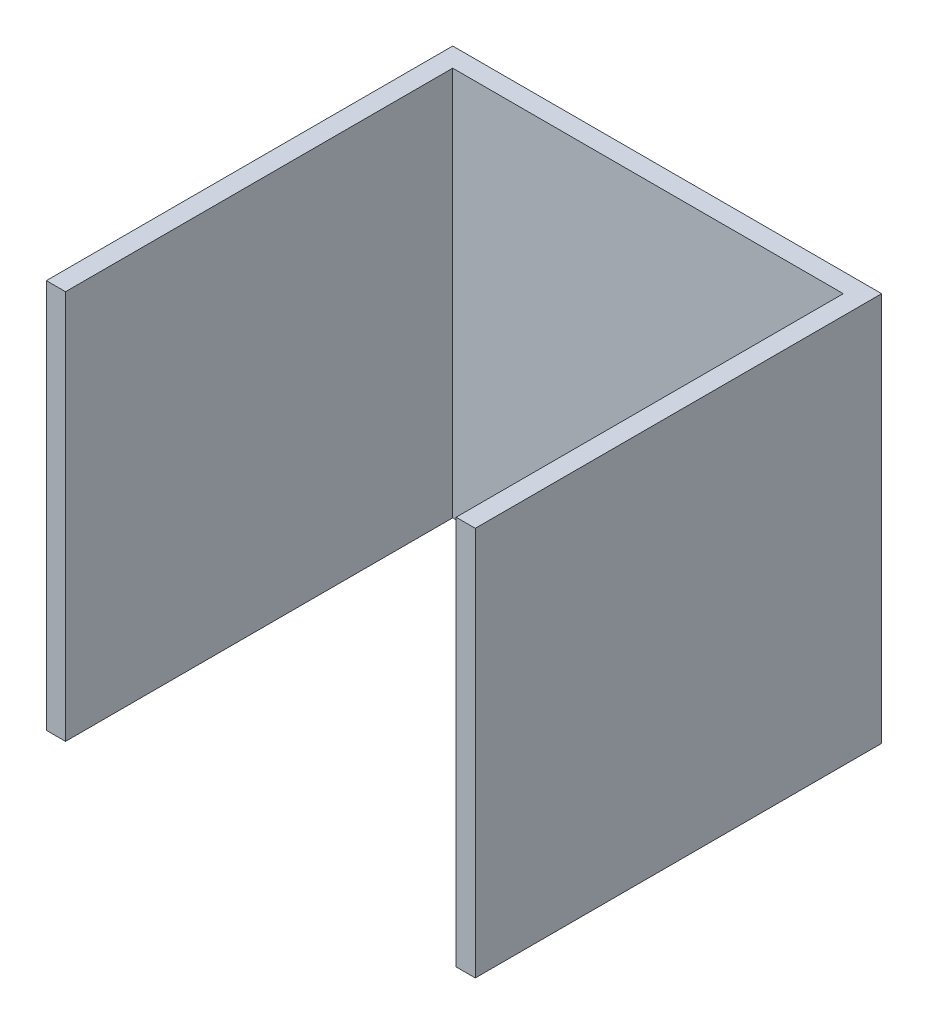
ISO-10303-21;
HEADER;
FILE_DESCRIPTION(('STEP AP214'),'2;1');
FILE_NAME('part.step','',(''),(''),'','','');
FILE_SCHEMA(('AUTOMOTIVE_DESIGN { 1 0 10303 214 1 1 1 1 }'));
ENDSEC;
DATA;
#1=APPLICATION_CONTEXT('core data for automotive mechanical design processes');
#2=APPLICATION_PROTOCOL_DEFINITION('international standard','automotive_design',2000,#1);
#3=PRODUCT_CONTEXT('',#1,'mechanical');
#4=PRODUCT('Part','Part','',(#3));
#5=PRODUCT_RELATED_PRODUCT_CATEGORY('part','',(#4));
#6=PRODUCT_DEFINITION_FORMATION('','',#4);
#7=PRODUCT_DEFINITION_CONTEXT('part definition',#1,'design');
#8=PRODUCT_DEFINITION('design','',#6,#7);
#9=PRODUCT_DEFINITION_SHAPE('','',#8);
#10=(LENGTH_UNIT() NAMED_UNIT(*) SI_UNIT(.MILLI.,.METRE.));
#11=(NAMED_UNIT(*) PLANE_ANGLE_UNIT() SI_UNIT($,.RADIAN.));
#12=(NAMED_UNIT(*) SI_UNIT($,.STERADIAN.) SOLID_ANGLE_UNIT());
#13=UNCERTAINTY_MEASURE_WITH_UNIT(LENGTH_MEASURE(1.E-05),#10,'distance_accuracy_value','');
#14=(GEOMETRIC_REPRESENTATION_CONTEXT(3) GLOBAL_UNCERTAINTY_ASSIGNED_CONTEXT((#13)) GLOBAL_UNIT_ASSIGNED_CONTEXT((#10,
#11,#12)) REPRESENTATION_CONTEXT('',''));
#15=CARTESIAN_POINT('',(0.,0.,0.));
#16=DIRECTION('',(0.,0.,1.));
#17=DIRECTION('',(1.,0.,0.));
#18=AXIS2_PLACEMENT_3D('',#15,#16,#17);
#19=CARTESIAN_POINT('',(0.,345.,0.));
#20=DIRECTION('',(0.,0.,-1.));
#21=DIRECTION('',(-1.,0.,0.));
#22=AXIS2_PLACEMENT_3D('',#19,#20,#21);
#23=PLANE('',#22);
#24=DIRECTION('',(1.,0.,0.));
#25=VECTOR('',#24,1.);
#26=CARTESIAN_POINT('',(0.,0.,0.));
#27=LINE('',#26,#25);
#28=CARTESIAN_POINT('',(0.,0.,0.));
#29=VERTEX_POINT('',#28);
#30=CARTESIAN_POINT('',(17.,0.,0.));
#31=VERTEX_POINT('',#30);
#32=EDGE_CURVE('E128',#29,#31,#27,.T.);
#33=ORIENTED_EDGE('',*,*,#32,.T.);
#34=DIRECTION('',(0.,-1.,0.));
#35=VECTOR('',#34,1.);
#36=CARTESIAN_POINT('',(17.,345.,0.));
#37=LINE('',#36,#35);
#38=CARTESIAN_POINT('',(17.,345.,0.));
#39=VERTEX_POINT('',#38);
#40=EDGE_CURVE('E11',#39,#31,#37,.T.);
#41=ORIENTED_EDGE('',*,*,#40,.F.);
#42=DIRECTION('',(1.,0.,0.));
#43=VECTOR('',#42,1.);
#44=CARTESIAN_POINT('',(0.,345.,0.));
#45=LINE('',#44,#43);
#46=CARTESIAN_POINT('',(0.,345.,0.));
#47=VERTEX_POINT('',#46);
#48=EDGE_CURVE('E142',#47,#39,#45,.T.);
#49=ORIENTED_EDGE('',*,*,#48,.F.);
#50=DIRECTION('',(0.,-1.,0.));
#51=VECTOR('',#50,1.);
#52=CARTESIAN_POINT('',(0.,345.,0.));
#53=LINE('',#52,#51);
#54=EDGE_CURVE('E124',#47,#29,#53,.T.);
#55=ORIENTED_EDGE('',*,*,#54,.T.);
#56=EDGE_LOOP('',(#33,#41,#49,#55));
#57=FACE_BOUND('',#56,.T.);
#58=ADVANCED_FACE('F32',(#57),#23,.F.);
#59=CARTESIAN_POINT('',(17.,345.,0.));
#60=DIRECTION('',(-1.,0.,0.));
#61=DIRECTION('',(0.,0.,1.));
#62=AXIS2_PLACEMENT_3D('',#59,#60,#61);
#63=PLANE('',#62);
#64=DIRECTION('',(0.,0.,-1.));
#65=VECTOR('',#64,1.);
#66=CARTESIAN_POINT('',(17.,0.,0.));
#67=LINE('',#66,#65);
#68=CARTESIAN_POINT('',(17.,0.,-343.));
#69=VERTEX_POINT('',#68);
#70=EDGE_CURVE('E131',#31,#69,#67,.T.);
#71=ORIENTED_EDGE('',*,*,#70,.T.);
#72=DIRECTION('',(0.,-1.,0.));
#73=VECTOR('',#72,1.);
#74=CARTESIAN_POINT('',(17.,345.,-343.));
#75=LINE('',#74,#73);
#76=CARTESIAN_POINT('',(17.,345.,-343.));
#77=VERTEX_POINT('',#76);
#78=EDGE_CURVE('E40',#77,#69,#75,.T.);
#79=ORIENTED_EDGE('',*,*,#78,.F.);
#80=DIRECTION('',(0.,0.,-1.));
#81=VECTOR('',#80,1.);
#82=CARTESIAN_POINT('',(17.,345.,0.));
#83=LINE('',#82,#81);
#84=EDGE_CURVE('E91',#39,#77,#83,.T.);
#85=ORIENTED_EDGE('',*,*,#84,.F.);
#86=ORIENTED_EDGE('',*,*,#40,.T.);
#87=EDGE_LOOP('',(#71,#79,#85,#86));
#88=FACE_BOUND('',#87,.T.);
#89=ADVANCED_FACE('F177',(#88),#63,.F.);
#90=CARTESIAN_POINT('',(17.,345.,-343.));
#91=DIRECTION('',(0.,0.,-1.));
#92=DIRECTION('',(-1.,0.,0.));
#93=AXIS2_PLACEMENT_3D('',#90,#91,#92);
#94=PLANE('',#93);
#95=DIRECTION('',(1.,0.,0.));
#96=VECTOR('',#95,1.);
#97=CARTESIAN_POINT('',(17.,0.,-343.));
#98=LINE('',#97,#96);
#99=CARTESIAN_POINT('',(363.,0.,-343.));
#100=VERTEX_POINT('',#99);
#101=EDGE_CURVE('E133',#69,#100,#98,.T.);
#102=ORIENTED_EDGE('',*,*,#101,.T.);
#103=DIRECTION('',(0.,-1.,0.));
#104=VECTOR('',#103,1.);
#105=CARTESIAN_POINT('',(363.,345.,-343.));
#106=LINE('',#105,#104);
#107=CARTESIAN_POINT('',(363.,345.,-343.));
#108=VERTEX_POINT('',#107);
#109=EDGE_CURVE('E149',#108,#100,#106,.T.);
#110=ORIENTED_EDGE('',*,*,#109,.F.);
#111=DIRECTION('',(1.,0.,0.));
#112=VECTOR('',#111,1.);
#113=CARTESIAN_POINT('',(17.,345.,-343.));
#114=LINE('',#113,#112);
#115=EDGE_CURVE('E157',#77,#108,#114,.T.);
#116=ORIENTED_EDGE('',*,*,#115,.F.);
#117=ORIENTED_EDGE('',*,*,#78,.T.);
#118=EDGE_LOOP('',(#102,#110,#116,#117));
#119=FACE_BOUND('',#118,.T.);
#120=ADVANCED_FACE('F155',(#119),#94,.F.);
#121=CARTESIAN_POINT('',(363.,345.,0.));
#122=DIRECTION('',(1.,0.,0.));
#123=DIRECTION('',(0.,0.,-1.));
#124=AXIS2_PLACEMENT_3D('',#121,#122,#123);
#125=PLANE('',#124);
#126=DIRECTION('',(0.,0.,1.));
#127=VECTOR('',#126,1.);
#128=CARTESIAN_POINT('',(363.,0.,0.));
#129=LINE('',#128,#127);
#130=CARTESIAN_POINT('',(363.,0.,0.));
#131=VERTEX_POINT('',#130);
#132=EDGE_CURVE('E135',#100,#131,#129,.T.);
#133=ORIENTED_EDGE('',*,*,#132,.T.);
#134=DIRECTION('',(0.,-1.,0.));
#135=VECTOR('',#134,1.);
#136=CARTESIAN_POINT('',(363.,345.,0.));
#137=LINE('',#136,#135);
#138=CARTESIAN_POINT('',(363.,345.,0.));
#139=VERTEX_POINT('',#138);
#140=EDGE_CURVE('E146',#139,#131,#137,.T.);
#141=ORIENTED_EDGE('',*,*,#140,.F.);
#142=DIRECTION('',(0.,0.,1.));
#143=VECTOR('',#142,1.);
#144=CARTESIAN_POINT('',(363.,345.,0.));
#145=LINE('',#144,#143);
#146=EDGE_CURVE('E169',#108,#139,#145,.T.);
#147=ORIENTED_EDGE('',*,*,#146,.F.);
#148=ORIENTED_EDGE('',*,*,#109,.T.);
#149=EDGE_LOOP('',(#133,#141,#147,#148));
#150=FACE_BOUND('',#149,.T.);
#151=ADVANCED_FACE('F165',(#150),#125,.F.);
#152=CARTESIAN_POINT('',(363.,345.,0.));
#153=DIRECTION('',(0.,0.,-1.));
#154=DIRECTION('',(-1.,0.,0.));
#155=AXIS2_PLACEMENT_3D('',#152,#153,#154);
#156=PLANE('',#155);
#157=DIRECTION('',(1.,0.,0.));
#158=VECTOR('',#157,1.);
#159=CARTESIAN_POINT('',(363.,0.,0.));
#160=LINE('',#159,#158);
#161=CARTESIAN_POINT('',(380.,0.,0.));
#162=VERTEX_POINT('',#161);
#163=EDGE_CURVE('E137',#131,#162,#160,.T.);
#164=ORIENTED_EDGE('',*,*,#163,.T.);
#165=DIRECTION('',(0.,-1.,0.));
#166=VECTOR('',#165,1.);
#167=CARTESIAN_POINT('',(380.,345.,0.));
#168=LINE('',#167,#166);
#169=CARTESIAN_POINT('',(380.,345.,0.));
#170=VERTEX_POINT('',#169);
#171=EDGE_CURVE('E119',#170,#162,#168,.T.);
#172=ORIENTED_EDGE('',*,*,#171,.F.);
#173=DIRECTION('',(1.,0.,0.));
#174=VECTOR('',#173,1.);
#175=CARTESIAN_POINT('',(363.,345.,0.));
#176=LINE('',#175,#174);
#177=EDGE_CURVE('E110',#139,#170,#176,.T.);
#178=ORIENTED_EDGE('',*,*,#177,.F.);
#179=ORIENTED_EDGE('',*,*,#140,.T.);
#180=EDGE_LOOP('',(#164,#172,#178,#179));
#181=FACE_BOUND('',#180,.T.);
#182=ADVANCED_FACE('F168',(#181),#156,.F.);
#183=CARTESIAN_POINT('',(380.,345.,0.));
#184=DIRECTION('',(-1.,0.,0.));
#185=DIRECTION('',(0.,0.,1.));
#186=AXIS2_PLACEMENT_3D('',#183,#184,#185);
#187=PLANE('',#186);
#188=DIRECTION('',(0.,0.,-1.));
#189=VECTOR('',#188,1.);
#190=CARTESIAN_POINT('',(380.,0.,0.));
#191=LINE('',#190,#189);
#192=CARTESIAN_POINT('',(380.,0.,-360.));
#193=VERTEX_POINT('',#192);
#194=EDGE_CURVE('E118',#162,#193,#191,.T.);
#195=ORIENTED_EDGE('',*,*,#194,.T.);
#196=DIRECTION('',(0.,-1.,0.));
#197=VECTOR('',#196,1.);
#198=CARTESIAN_POINT('',(380.,345.,-360.));
#199=LINE('',#198,#197);
#200=CARTESIAN_POINT('',(380.,345.,-360.));
#201=VERTEX_POINT('',#200);
#202=EDGE_CURVE('E115',#201,#193,#199,.T.);
#203=ORIENTED_EDGE('',*,*,#202,.F.);
#204=DIRECTION('',(0.,0.,-1.));
#205=VECTOR('',#204,1.);
#206=CARTESIAN_POINT('',(380.,345.,0.));
#207=LINE('',#206,#205);
#208=EDGE_CURVE('E104',#170,#201,#207,.T.);
#209=ORIENTED_EDGE('',*,*,#208,.F.);
#210=ORIENTED_EDGE('',*,*,#171,.T.);
#211=EDGE_LOOP('',(#195,#203,#209,#210));
#212=FACE_BOUND('',#211,.T.);
#213=ADVANCED_FACE('F116',(#212),#187,.F.);
#214=CARTESIAN_POINT('',(0.,345.,-360.));
#215=DIRECTION('',(0.,0.,1.));
#216=DIRECTION('',(1.,0.,0.));
#217=AXIS2_PLACEMENT_3D('',#214,#215,#216);
#218=PLANE('',#217);
#219=DIRECTION('',(-1.,0.,0.));
#220=VECTOR('',#219,1.);
#221=CARTESIAN_POINT('',(0.,0.,-360.));
#222=LINE('',#221,#220);
#223=CARTESIAN_POINT('',(0.,0.,-360.));
#224=VERTEX_POINT('',#223);
#225=EDGE_CURVE('E77',#193,#224,#222,.T.);
#226=ORIENTED_EDGE('',*,*,#225,.T.);
#227=DIRECTION('',(0.,-1.,0.));
#228=VECTOR('',#227,1.);
#229=CARTESIAN_POINT('',(0.,345.,-360.));
#230=LINE('',#229,#228);
#231=CARTESIAN_POINT('',(0.,345.,-360.));
#232=VERTEX_POINT('',#231);
#233=EDGE_CURVE('E120',#232,#224,#230,.T.);
#234=ORIENTED_EDGE('',*,*,#233,.F.);
#235=DIRECTION('',(-1.,0.,0.));
#236=VECTOR('',#235,1.);
#237=CARTESIAN_POINT('',(0.,345.,-360.));
#238=LINE('',#237,#236);
#239=EDGE_CURVE('E108',#201,#232,#238,.T.);
#240=ORIENTED_EDGE('',*,*,#239,.F.);
#241=ORIENTED_EDGE('',*,*,#202,.T.);
#242=EDGE_LOOP('',(#226,#234,#240,#241));
#243=FACE_BOUND('',#242,.T.);
#244=ADVANCED_FACE('F122',(#243),#218,.F.);
#245=CARTESIAN_POINT('',(0.,345.,0.));
#246=DIRECTION('',(1.,0.,0.));
#247=DIRECTION('',(0.,0.,-1.));
#248=AXIS2_PLACEMENT_3D('',#245,#246,#247);
#249=PLANE('',#248);
#250=DIRECTION('',(0.,0.,1.));
#251=VECTOR('',#250,1.);
#252=CARTESIAN_POINT('',(0.,0.,0.));
#253=LINE('',#252,#251);
#254=EDGE_CURVE('E83',#224,#29,#253,.T.);
#255=ORIENTED_EDGE('',*,*,#254,.T.);
#256=ORIENTED_EDGE('',*,*,#54,.F.);
#257=DIRECTION('',(0.,0.,1.));
#258=VECTOR('',#257,1.);
#259=CARTESIAN_POINT('',(0.,345.,0.));
#260=LINE('',#259,#258);
#261=EDGE_CURVE('E48',#232,#47,#260,.T.);
#262=ORIENTED_EDGE('',*,*,#261,.F.);
#263=ORIENTED_EDGE('',*,*,#233,.T.);
#264=EDGE_LOOP('',(#255,#256,#262,#263));
#265=FACE_BOUND('',#264,.T.);
#266=ADVANCED_FACE('F193',(#265),#249,.F.);
#267=CARTESIAN_POINT('',(0.,345.,0.));
#268=DIRECTION('',(0.,1.,0.));
#269=DIRECTION('',(0.,0.,1.));
#270=AXIS2_PLACEMENT_3D('',#267,#268,#269);
#271=PLANE('',#270);
#272=ORIENTED_EDGE('',*,*,#48,.T.);
#273=ORIENTED_EDGE('',*,*,#84,.T.);
#274=ORIENTED_EDGE('',*,*,#115,.T.);
#275=ORIENTED_EDGE('',*,*,#146,.T.);
#276=ORIENTED_EDGE('',*,*,#177,.T.);
#277=ORIENTED_EDGE('',*,*,#208,.T.);
#278=ORIENTED_EDGE('',*,*,#239,.T.);
#279=ORIENTED_EDGE('',*,*,#261,.T.);
#280=EDGE_LOOP('',(#272,#273,#274,#275,#276,#277,#278,#279));
#281=FACE_BOUND('',#280,.T.);
#282=ADVANCED_FACE('F106',(#281),#271,.T.);
#283=CARTESIAN_POINT('',(0.,0.,0.));
#284=DIRECTION('',(0.,1.,0.));
#285=DIRECTION('',(0.,0.,1.));
#286=AXIS2_PLACEMENT_3D('',#283,#284,#285);
#287=PLANE('',#286);
#288=ORIENTED_EDGE('',*,*,#32,.F.);
#289=ORIENTED_EDGE('',*,*,#254,.F.);
#290=ORIENTED_EDGE('',*,*,#225,.F.);
#291=ORIENTED_EDGE('',*,*,#194,.F.);
#292=ORIENTED_EDGE('',*,*,#163,.F.);
#293=ORIENTED_EDGE('',*,*,#132,.F.);
#294=ORIENTED_EDGE('',*,*,#101,.F.);
#295=ORIENTED_EDGE('',*,*,#70,.F.);
#296=EDGE_LOOP('',(#288,#289,#290,#291,#292,#293,#294,#295));
#297=FACE_BOUND('',#296,.T.);
#298=ADVANCED_FACE('F161',(#297),#287,.F.);
#299=CLOSED_SHELL('',(#58,#89,#120,#151,#182,#213,#244,#266,#282,#298));
#300=MANIFOLD_SOLID_BREP('B2',#299);
#301=ADVANCED_BREP_SHAPE_REPRESENTATION('',(#18,#300),#14);
#302=SHAPE_DEFINITION_REPRESENTATION(#9,#301);
ENDSEC;
END-ISO-10303-21;
